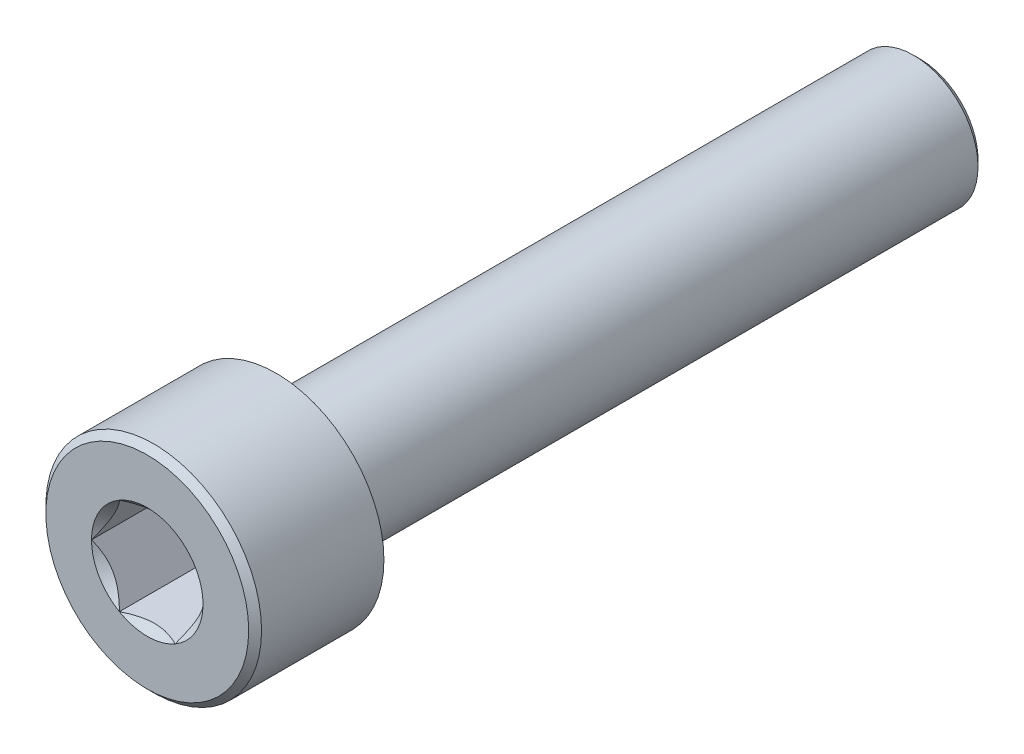
ISO-10303-21;
HEADER;
FILE_DESCRIPTION(('STEP AP214'),'2;1');
FILE_NAME('part.step','',(''),(''),'','','');
FILE_SCHEMA(('AUTOMOTIVE_DESIGN { 1 0 10303 214 1 1 1 1 }'));
ENDSEC;
DATA;
#1=APPLICATION_CONTEXT('core data for automotive mechanical design processes');
#2=APPLICATION_PROTOCOL_DEFINITION('international standard','automotive_design',2000,#1);
#3=PRODUCT_CONTEXT('',#1,'mechanical');
#4=PRODUCT('Part','Part','',(#3));
#5=PRODUCT_RELATED_PRODUCT_CATEGORY('part','',(#4));
#6=PRODUCT_DEFINITION_FORMATION('','',#4);
#7=PRODUCT_DEFINITION_CONTEXT('part definition',#1,'design');
#8=PRODUCT_DEFINITION('design','',#6,#7);
#9=PRODUCT_DEFINITION_SHAPE('','',#8);
#10=(LENGTH_UNIT() NAMED_UNIT(*) SI_UNIT(.MILLI.,.METRE.));
#11=(NAMED_UNIT(*) PLANE_ANGLE_UNIT() SI_UNIT($,.RADIAN.));
#12=(NAMED_UNIT(*) SI_UNIT($,.STERADIAN.) SOLID_ANGLE_UNIT());
#13=UNCERTAINTY_MEASURE_WITH_UNIT(LENGTH_MEASURE(1.E-05),#10,'distance_accuracy_value','');
#14=(GEOMETRIC_REPRESENTATION_CONTEXT(3) GLOBAL_UNCERTAINTY_ASSIGNED_CONTEXT((#13)) GLOBAL_UNIT_ASSIGNED_CONTEXT((#10,
#11,#12)) REPRESENTATION_CONTEXT('',''));
#15=CARTESIAN_POINT('',(0.,0.,0.));
#16=DIRECTION('',(0.,0.,1.));
#17=DIRECTION('',(1.,0.,0.));
#18=AXIS2_PLACEMENT_3D('',#15,#16,#17);
#19=CARTESIAN_POINT('',(0.,0.,0.));
#20=DIRECTION('',(0.,0.,1.));
#21=DIRECTION('',(1.,0.,0.));
#22=AXIS2_PLACEMENT_3D('',#19,#20,#21);
#23=PLANE('',#22);
#24=CARTESIAN_POINT('',(0.,0.,0.));
#25=DIRECTION('',(0.,0.,1.));
#26=DIRECTION('',(1.,0.,0.));
#27=AXIS2_PLACEMENT_3D('',#24,#25,#26);
#28=CIRCLE('',#27,3.35);
#29=CARTESIAN_POINT('',(3.35,0.,0.));
#30=VERTEX_POINT('',#29);
#31=EDGE_CURVE('E244',#30,#30,#28,.T.);
#32=ORIENTED_EDGE('',*,*,#31,.F.);
#33=EDGE_LOOP('',(#32));
#34=FACE_BOUND('',#33,.T.);
#35=CARTESIAN_POINT('',(0.,0.,0.));
#36=DIRECTION('',(0.,0.,1.));
#37=DIRECTION('',(1.,0.,0.));
#38=AXIS2_PLACEMENT_3D('',#35,#36,#37);
#39=CIRCLE('',#38,2.);
#40=CARTESIAN_POINT('',(2.,0.,0.));
#41=VERTEX_POINT('',#40);
#42=EDGE_CURVE('E109',#41,#41,#39,.F.);
#43=ORIENTED_EDGE('',*,*,#42,.F.);
#44=EDGE_LOOP('',(#43));
#45=FACE_BOUND('',#44,.T.);
#46=ADVANCED_FACE('F34',(#34,#45),#23,.F.);
#47=CARTESIAN_POINT('',(0.,0.,4.));
#48=DIRECTION('',(0.,0.,-1.));
#49=DIRECTION('',(-1.,0.,0.));
#50=AXIS2_PLACEMENT_3D('',#47,#48,#49);
#51=CYLINDRICAL_SURFACE('',#50,3.35);
#52=CARTESIAN_POINT('',(0.,0.,3.8));
#53=DIRECTION('',(0.,0.,1.));
#54=DIRECTION('',(1.,0.,0.));
#55=AXIS2_PLACEMENT_3D('',#52,#53,#54);
#56=CIRCLE('',#55,3.35);
#57=CARTESIAN_POINT('',(3.35,0.,3.8));
#58=VERTEX_POINT('',#57);
#59=EDGE_CURVE('E11',#58,#58,#56,.F.);
#60=ORIENTED_EDGE('',*,*,#59,.T.);
#61=EDGE_LOOP('',(#60));
#62=FACE_BOUND('',#61,.T.);
#63=ORIENTED_EDGE('',*,*,#31,.T.);
#64=EDGE_LOOP('',(#63));
#65=FACE_BOUND('',#64,.T.);
#66=ADVANCED_FACE('F185',(#62,#65),#51,.T.);
#67=CARTESIAN_POINT('',(0.,0.,4.));
#68=DIRECTION('',(0.,0.,1.));
#69=DIRECTION('',(1.,0.,0.));
#70=AXIS2_PLACEMENT_3D('',#67,#68,#69);
#71=PLANE('',#70);
#72=CARTESIAN_POINT('',(0.,0.,4.));
#73=DIRECTION('',(0.,0.,1.));
#74=DIRECTION('',(1.,0.,0.));
#75=AXIS2_PLACEMENT_3D('',#72,#73,#74);
#76=CIRCLE('',#75,3.15);
#77=CARTESIAN_POINT('',(3.15,0.,4.));
#78=VERTEX_POINT('',#77);
#79=EDGE_CURVE('E42',#78,#78,#76,.T.);
#80=ORIENTED_EDGE('',*,*,#79,.T.);
#81=EDGE_LOOP('',(#80));
#82=FACE_BOUND('',#81,.T.);
#83=CARTESIAN_POINT('',(0.,0.,4.));
#84=DIRECTION('',(0.,0.,1.));
#85=DIRECTION('',(1.,0.,0.));
#86=AXIS2_PLACEMENT_3D('',#83,#84,#85);
#87=CIRCLE('',#86,1.73205080756889);
#88=CARTESIAN_POINT('',(1.73205080756889,0.,4.));
#89=VERTEX_POINT('',#88);
#90=CARTESIAN_POINT('',(0.866025403784432,1.50000000000001,4.));
#91=VERTEX_POINT('',#90);
#92=EDGE_CURVE('E99',#89,#91,#87,.T.);
#93=ORIENTED_EDGE('',*,*,#92,.F.);
#94=CARTESIAN_POINT('',(0.866025403784432,-1.50000000000001,4.));
#95=VERTEX_POINT('',#94);
#96=EDGE_CURVE('E88',#95,#89,#87,.T.);
#97=ORIENTED_EDGE('',*,*,#96,.F.);
#98=CARTESIAN_POINT('',(-0.866025403784454,-1.5,4.));
#99=VERTEX_POINT('',#98);
#100=EDGE_CURVE('E97',#99,#95,#87,.T.);
#101=ORIENTED_EDGE('',*,*,#100,.F.);
#102=CARTESIAN_POINT('',(-1.73205080756889,0.,4.));
#103=VERTEX_POINT('',#102);
#104=EDGE_CURVE('E48',#103,#99,#87,.T.);
#105=ORIENTED_EDGE('',*,*,#104,.F.);
#106=CARTESIAN_POINT('',(-0.866025403784433,1.50000000000001,4.));
#107=VERTEX_POINT('',#106);
#108=EDGE_CURVE('E55',#107,#103,#87,.T.);
#109=ORIENTED_EDGE('',*,*,#108,.F.);
#110=EDGE_CURVE('E130',#91,#107,#87,.T.);
#111=ORIENTED_EDGE('',*,*,#110,.F.);
#112=EDGE_LOOP('',(#93,#97,#101,#105,#109,#111));
#113=FACE_BOUND('',#112,.T.);
#114=ADVANCED_FACE('F129',(#82,#113),#71,.T.);
#115=CARTESIAN_POINT('',(0.,0.,-20.));
#116=DIRECTION('',(0.,0.,1.));
#117=DIRECTION('',(1.,0.,0.));
#118=AXIS2_PLACEMENT_3D('',#115,#116,#117);
#119=CYLINDRICAL_SURFACE('',#118,2.);
#120=CARTESIAN_POINT('',(0.,0.,-19.8));
#121=DIRECTION('',(0.,0.,-1.));
#122=DIRECTION('',(-1.,0.,0.));
#123=AXIS2_PLACEMENT_3D('',#120,#121,#122);
#124=CIRCLE('',#123,2.);
#125=CARTESIAN_POINT('',(-2.,0.,-19.8));
#126=VERTEX_POINT('',#125);
#127=EDGE_CURVE('E170',#126,#126,#124,.F.);
#128=ORIENTED_EDGE('',*,*,#127,.T.);
#129=EDGE_LOOP('',(#128));
#130=FACE_BOUND('',#129,.T.);
#131=ORIENTED_EDGE('',*,*,#42,.T.);
#132=EDGE_LOOP('',(#131));
#133=FACE_BOUND('',#132,.T.);
#134=ADVANCED_FACE('F196',(#130,#133),#119,.T.);
#135=CARTESIAN_POINT('',(0.,0.,-20.));
#136=DIRECTION('',(0.,0.,-1.));
#137=DIRECTION('',(-1.,0.,0.));
#138=AXIS2_PLACEMENT_3D('',#135,#136,#137);
#139=PLANE('',#138);
#140=CARTESIAN_POINT('',(0.,0.,-20.));
#141=DIRECTION('',(0.,0.,-1.));
#142=DIRECTION('',(-1.,0.,0.));
#143=AXIS2_PLACEMENT_3D('',#140,#141,#142);
#144=CIRCLE('',#143,1.8);
#145=CARTESIAN_POINT('',(-1.8,0.,-20.));
#146=VERTEX_POINT('',#145);
#147=EDGE_CURVE('E108',#146,#146,#144,.T.);
#148=ORIENTED_EDGE('',*,*,#147,.T.);
#149=EDGE_LOOP('',(#148));
#150=FACE_BOUND('',#149,.T.);
#151=ADVANCED_FACE('F200',(#150),#139,.T.);
#152=CARTESIAN_POINT('',(0.,0.,4.));
#153=DIRECTION('',(0.,0.,1.));
#154=DIRECTION('',(1.,0.,0.));
#155=AXIS2_PLACEMENT_3D('',#152,#153,#154);
#156=CONICAL_SURFACE('',#155,1.73205080756889,0.78539816339745);
#157=ORIENTED_EDGE('',*,*,#92,.T.);
#158=CARTESIAN_POINT('',(1.73216627762272,-0.0002,4.00011548160007));
#159=CARTESIAN_POINT('',(1.70239359975915,0.0513677907370756,3.97036547606732));
#160=CARTESIAN_POINT('',(1.67212305186355,0.103797917665201,3.94236248391031));
#161=CARTESIAN_POINT('',(1.61039789003619,0.210709034055597,3.89108923044014));
#162=CARTESIAN_POINT('',(1.57893740312614,0.265200195814661,3.86784750504437));
#163=CARTESIAN_POINT('',(1.51549879897987,0.375079081357248,3.82803372899221));
#164=CARTESIAN_POINT('',(1.4835368452681,0.4304388090952,3.81136158567089));
#165=CARTESIAN_POINT('',(1.41890915196211,0.542377257477151,3.7856744568181));
#166=CARTESIAN_POINT('',(1.38624538781118,0.598952556553009,3.77664029047886));
#167=CARTESIAN_POINT('',(1.329952100953,0.696455389516441,3.76848908122684));
#168=CARTESIAN_POINT('',(1.30639533311124,0.737256908280467,3.76728225298921));
#169=CARTESIAN_POINT('',(1.25932335290194,0.818787969615859,3.76931405716226));
#170=CARTESIAN_POINT('',(1.23580815085313,0.859517494314631,3.7725536707483));
#171=CARTESIAN_POINT('',(1.18900414978427,0.940584402163417,3.78329198598195));
#172=CARTESIAN_POINT('',(1.1657155821172,0.980921384598289,3.79079465301873));
#173=CARTESIAN_POINT('',(1.11952932016335,1.06091833691403,3.80965161192828));
#174=CARTESIAN_POINT('',(1.09663179808786,1.10057800851621,3.82100755701858));
#175=CARTESIAN_POINT('',(1.03798159809698,1.20216313477449,3.85472164759266));
#176=CARTESIAN_POINT('',(1.00259267147465,1.26345855370969,3.87962184909336));
#177=CARTESIAN_POINT('',(0.950557780604371,1.35358562846332,3.92165665327157));
#178=CARTESIAN_POINT('',(0.933410759677143,1.38328513990773,3.93642515355909));
#179=CARTESIAN_POINT('',(0.899432101996402,1.44213790138376,3.96731056594017));
#180=CARTESIAN_POINT('',(0.882600319285704,1.47129140422065,3.98342683412171));
#181=CARTESIAN_POINT('',(0.865909933730595,1.50020000000001,4.00011548160007));
#182=B_SPLINE_CURVE_WITH_KNOTS('',3,(#158,#159,#160,#161,#162,#163,#164,#165,#166,#167,#168,
#169,#170,#171,#172,#173,#174,#175,#176,#177,#178,#179,#180,#181),.UNSPECIFIED.,.F.,.F.,(4,2,2,
2,2,2,2,2,2,2,2,4),(0.,0.199829143693305,0.400822987382389,0.598623720538181,0.79592624018889,
0.937113067959882,1.07833105577193,1.21968061668222,1.36109089931055,1.58570969637566,
1.69770705470965,1.80965120737195),.UNSPECIFIED.);
#183=EDGE_CURVE('E103',#89,#91,#182,.T.);
#184=ORIENTED_EDGE('',*,*,#183,.F.);
#185=EDGE_LOOP('',(#157,#184));
#186=FACE_BOUND('',#185,.T.);
#187=ADVANCED_FACE('F104',(#186),#156,.F.);
#188=ORIENTED_EDGE('',*,*,#110,.T.);
#189=CARTESIAN_POINT('',(-1.72720812969693,1.50000000000001,4.5555785162708));
#190=CARTESIAN_POINT('',(-1.68515175699269,1.50000000000001,4.52382990785743));
#191=CARTESIAN_POINT('',(-1.64286104748674,1.50000000000001,4.49239259380739));
#192=CARTESIAN_POINT('',(-1.55771581035943,1.50000000000001,4.43026908755641));
#193=CARTESIAN_POINT('',(-1.51486114386669,1.50000000000001,4.39958308589221));
#194=CARTESIAN_POINT('',(-1.38468134151271,1.50000000000001,4.30840719242717));
#195=CARTESIAN_POINT('',(-1.29637976071654,1.50000000000001,4.24928834342678));
#196=CARTESIAN_POINT('',(-1.11121478730468,1.50000000000001,4.13323099631651));
#197=CARTESIAN_POINT('',(-1.01415038238168,1.50000000000001,4.07660955873301));
#198=CARTESIAN_POINT('',(-0.815173408897608,1.50000000000001,3.97303688126566));
#199=CARTESIAN_POINT('',(-0.713278669253288,1.50000000000001,3.92605304154167));
#200=CARTESIAN_POINT('',(-0.560333774943113,1.50000000000001,3.86857266843083));
#201=CARTESIAN_POINT('',(-0.511547982948043,1.50000000000001,3.85207538775725));
#202=CARTESIAN_POINT('',(-0.412798620136867,1.50000000000001,3.82299751292701));
#203=CARTESIAN_POINT('',(-0.362834968437563,1.50000000000001,3.81041718859402));
#204=CARTESIAN_POINT('',(-0.262863235444982,1.50000000000001,3.79003619414677));
#205=CARTESIAN_POINT('',(-0.212872113808022,1.50000000000001,3.78215363274599));
#206=CARTESIAN_POINT('',(-0.112355243569544,1.50000000000001,3.77132206396901));
#207=CARTESIAN_POINT('',(-0.061829588372626,1.50000000000001,3.76837220852436));
#208=CARTESIAN_POINT('',(0.0374291733323867,1.50000000000001,3.76762485772485));
#209=CARTESIAN_POINT('',(0.0861609672003019,1.50000000000001,3.76964473355808));
#210=CARTESIAN_POINT('',(0.18320693776883,1.50000000000001,3.77832255289676));
#211=CARTESIAN_POINT('',(0.231521073438273,1.50000000000001,3.78498094696846));
#212=CARTESIAN_POINT('',(0.32819985342544,1.50000000000001,3.80268524412257));
#213=CARTESIAN_POINT('',(0.376550616310333,1.50000000000001,3.81380581125704));
#214=CARTESIAN_POINT('',(0.472195697125604,1.50000000000001,3.83984341404872));
#215=CARTESIAN_POINT('',(0.519490103092746,1.50000000000001,3.85476013204094));
#216=CARTESIAN_POINT('',(0.668391282696632,1.50000000000001,3.90733522359608));
#217=CARTESIAN_POINT('',(0.767878709508561,1.50000000000001,3.95098128747198));
#218=CARTESIAN_POINT('',(0.962179866690734,1.50000000000001,4.04802299459311));
#219=CARTESIAN_POINT('',(1.05697519961445,1.50000000000001,4.10145366508954));
#220=CARTESIAN_POINT('',(1.23814273533384,1.50000000000001,4.21168585200457));
#221=CARTESIAN_POINT('',(1.32469942181291,1.50000000000001,4.26818792069861));
#222=CARTESIAN_POINT('',(1.45222331290675,1.50000000000001,4.35553430157867));
#223=CARTESIAN_POINT('',(1.49418091978757,1.50000000000001,4.38495775868006));
#224=CARTESIAN_POINT('',(1.57752272931478,1.50000000000001,4.44458282183048));
#225=CARTESIAN_POINT('',(1.61890708647356,1.50000000000001,4.47478421166445));
#226=CARTESIAN_POINT('',(1.66005278019496,1.50000000000001,4.50530817860947));
#227=B_SPLINE_CURVE_WITH_KNOTS('',3,(#189,#190,#191,#192,#193,#194,#195,#196,#197,#198,#199,
#200,#201,#202,#203,#204,#205,#206,#207,#208,#209,#210,#211,#212,#213,#214,#215,#216,#217,#218,
#219,#220,#221,#222,#223,#224,#225,#226),.UNSPECIFIED.,.F.,.F.,(4,2,2,2,2,2,2,2,2,2,2,2,2,2,2,2,
2,2,4),(0.,0.158079548982669,0.316198780993943,0.634850417346961,0.971690311361514,
1.30737131660667,1.46173961127089,1.61611853740678,1.7677210142141,1.91929742368539,
2.06538741209601,2.21149159305545,2.36014984633874,2.50879566386711,2.83376031422675,
3.15991186985654,3.469856018022,3.62358896039976,3.77727962642073),.UNSPECIFIED.);
#228=EDGE_CURVE('E131',#91,#107,#227,.F.);
#229=ORIENTED_EDGE('',*,*,#228,.F.);
#230=EDGE_LOOP('',(#188,#229));
#231=FACE_BOUND('',#230,.T.);
#232=ADVANCED_FACE('F271',(#231),#156,.F.);
#233=ORIENTED_EDGE('',*,*,#108,.T.);
#234=CARTESIAN_POINT('',(-0.865909933730605,1.50020000000001,4.00011548160008));
#235=CARTESIAN_POINT('',(-0.89568261159417,1.44863220926294,3.97036547606733));
#236=CARTESIAN_POINT('',(-0.92595315948977,1.39620208233481,3.94236248391032));
#237=CARTESIAN_POINT('',(-0.987678321317129,1.28929096594441,3.89108923044015));
#238=CARTESIAN_POINT('',(-1.01913880822718,1.23479980418535,3.86784750504438));
#239=CARTESIAN_POINT('',(-1.08257741237345,1.12492091864276,3.82803372899222));
#240=CARTESIAN_POINT('',(-1.11453936608522,1.06956119090481,3.8113615856709));
#241=CARTESIAN_POINT('',(-1.17916705939121,0.957622742522856,3.7856744568181));
#242=CARTESIAN_POINT('',(-1.21183082354214,0.901047443446997,3.77664029047887));
#243=CARTESIAN_POINT('',(-1.26812411040033,0.803544610483564,3.76848908122685));
#244=CARTESIAN_POINT('',(-1.29168087824209,0.762743091719538,3.76728225298922));
#245=CARTESIAN_POINT('',(-1.33875285845139,0.681212030384145,3.76931405716227));
#246=CARTESIAN_POINT('',(-1.36226806050019,0.640482505685373,3.77255367074831));
#247=CARTESIAN_POINT('',(-1.40907206156906,0.559415597836587,3.78329198598196));
#248=CARTESIAN_POINT('',(-1.43236062923613,0.519078615401715,3.79079465301873));
#249=CARTESIAN_POINT('',(-1.47854689118997,0.439081663085971,3.80965161192829));
#250=CARTESIAN_POINT('',(-1.50144441326546,0.399421991483794,3.82100755701859));
#251=CARTESIAN_POINT('',(-1.56009461325634,0.297836865225516,3.85472164759267));
#252=CARTESIAN_POINT('',(-1.59548353987867,0.236541446290311,3.87962184909337));
#253=CARTESIAN_POINT('',(-1.64751843074895,0.146414371536685,3.92165665327158));
#254=CARTESIAN_POINT('',(-1.66466545167618,0.11671486009228,3.9364251535591));
#255=CARTESIAN_POINT('',(-1.69864410935692,0.0578620986162462,3.96731056594017));
#256=CARTESIAN_POINT('',(-1.71547589206762,0.0287085957793595,3.98342683412171));
#257=CARTESIAN_POINT('',(-1.73216627762273,-0.000200000000003567,4.00011548160008));
#258=B_SPLINE_CURVE_WITH_KNOTS('',3,(#234,#235,#236,#237,#238,#239,#240,#241,#242,#243,#244,
#245,#246,#247,#248,#249,#250,#251,#252,#253,#254,#255,#256,#257),.UNSPECIFIED.,.F.,.F.,(4,2,2,
2,2,2,2,2,2,2,2,4),(0.,0.199829143693307,0.400822987382394,0.598623720538188,0.7959262401889,
0.937113067959893,1.07833105577194,1.21968061668223,1.36109089931056,1.58570969637567,
1.69770705470965,1.80965120737196),.UNSPECIFIED.);
#259=EDGE_CURVE('E133',#107,#103,#258,.T.);
#260=ORIENTED_EDGE('',*,*,#259,.F.);
#261=EDGE_LOOP('',(#233,#260));
#262=FACE_BOUND('',#261,.T.);
#263=ADVANCED_FACE('F268',(#262),#156,.F.);
#264=ORIENTED_EDGE('',*,*,#104,.T.);
#265=CARTESIAN_POINT('',(-1.73216627762273,0.000199999999996531,4.00011548160008));
#266=CARTESIAN_POINT('',(-1.70239359975916,-0.0513677907370794,3.97036547606733));
#267=CARTESIAN_POINT('',(-1.67212305186356,-0.103797917665205,3.94236248391032));
#268=CARTESIAN_POINT('',(-1.6103978900362,-0.210709034055601,3.89108923044015));
#269=CARTESIAN_POINT('',(-1.57893740312615,-0.265200195814666,3.86784750504438));
#270=CARTESIAN_POINT('',(-1.51549879897988,-0.375079081357253,3.82803372899222));
#271=CARTESIAN_POINT('',(-1.48353684526811,-0.430438809095205,3.8113615856709));
#272=CARTESIAN_POINT('',(-1.41890915196212,-0.542377257477156,3.78567445681811));
#273=CARTESIAN_POINT('',(-1.38624538781119,-0.598952556553014,3.77664029047887));
#274=CARTESIAN_POINT('',(-1.32995210095301,-0.696455389516447,3.76848908122686));
#275=CARTESIAN_POINT('',(-1.30639533311125,-0.737256908280473,3.76728225298922));
#276=CARTESIAN_POINT('',(-1.25932335290195,-0.818787969615865,3.76931405716227));
#277=CARTESIAN_POINT('',(-1.23580815085314,-0.859517494314637,3.77255367074831));
#278=CARTESIAN_POINT('',(-1.18900414978428,-0.940584402163424,3.78329198598197));
#279=CARTESIAN_POINT('',(-1.16571558211721,-0.980921384598297,3.79079465301874));
#280=CARTESIAN_POINT('',(-1.11952932016336,-1.06091833691404,3.8096516119283));
#281=CARTESIAN_POINT('',(-1.09663179808787,-1.10057800851622,3.82100755701859));
#282=CARTESIAN_POINT('',(-1.03798159809699,-1.20216313477449,3.85472164759268));
#283=CARTESIAN_POINT('',(-1.00259267147466,-1.2634585537097,3.87962184909337));
#284=CARTESIAN_POINT('',(-0.950557780604385,-1.35358562846332,3.92165665327158));
#285=CARTESIAN_POINT('',(-0.933410759677158,-1.38328513990773,3.9364251535591));
#286=CARTESIAN_POINT('',(-0.899432101996418,-1.44213790138376,3.96731056594017));
#287=CARTESIAN_POINT('',(-0.882600319285721,-1.47129140422065,3.98342683412172));
#288=CARTESIAN_POINT('',(-0.865909933730612,-1.50020000000001,4.00011548160008));
#289=B_SPLINE_CURVE_WITH_KNOTS('',3,(#265,#266,#267,#268,#269,#270,#271,#272,#273,#274,#275,
#276,#277,#278,#279,#280,#281,#282,#283,#284,#285,#286,#287,#288),.UNSPECIFIED.,.F.,.F.,(4,2,2,
2,2,2,2,2,2,2,2,4),(0.,0.199829143693305,0.40082298738239,0.598623720538182,0.795926240188891,
0.937113067959884,1.07833105577193,1.21968061668222,1.36109089931055,1.58570969637566,
1.69770705470964,1.80965120737194),.UNSPECIFIED.);
#290=EDGE_CURVE('E222',#103,#99,#289,.T.);
#291=ORIENTED_EDGE('',*,*,#290,.F.);
#292=EDGE_LOOP('',(#264,#291));
#293=FACE_BOUND('',#292,.T.);
#294=ADVANCED_FACE('F270',(#293),#156,.F.);
#295=ORIENTED_EDGE('',*,*,#100,.T.);
#296=CARTESIAN_POINT('',(-1.72720812969695,-1.50000000000001,4.55557851627081));
#297=CARTESIAN_POINT('',(-1.6851517569927,-1.50000000000001,4.52382990785744));
#298=CARTESIAN_POINT('',(-1.64286104748676,-1.50000000000001,4.4923925938074));
#299=CARTESIAN_POINT('',(-1.55771581035944,-1.50000000000001,4.43026908755642));
#300=CARTESIAN_POINT('',(-1.5148611438667,-1.50000000000001,4.39958308589221));
#301=CARTESIAN_POINT('',(-1.38468134151272,-1.50000000000001,4.30840719242717));
#302=CARTESIAN_POINT('',(-1.29637976071655,-1.50000000000001,4.24928834342678));
#303=CARTESIAN_POINT('',(-1.11121478730469,-1.50000000000001,4.13323099631651));
#304=CARTESIAN_POINT('',(-1.01415038238169,-1.50000000000001,4.07660955873301));
#305=CARTESIAN_POINT('',(-0.815173408897617,-1.50000000000001,3.97303688126566));
#306=CARTESIAN_POINT('',(-0.713278669253296,-1.50000000000001,3.92605304154167));
#307=CARTESIAN_POINT('',(-0.56033377494312,-1.50000000000001,3.86857266843083));
#308=CARTESIAN_POINT('',(-0.51154798294805,-1.50000000000001,3.85207538775725));
#309=CARTESIAN_POINT('',(-0.412798620136874,-1.50000000000001,3.82299751292701));
#310=CARTESIAN_POINT('',(-0.362834968437569,-1.50000000000001,3.81041718859402));
#311=CARTESIAN_POINT('',(-0.262863235444988,-1.50000000000001,3.79003619414677));
#312=CARTESIAN_POINT('',(-0.212872113808028,-1.50000000000001,3.78215363274598));
#313=CARTESIAN_POINT('',(-0.11235524356955,-1.50000000000001,3.771322063969));
#314=CARTESIAN_POINT('',(-0.0618295883726318,-1.50000000000001,3.76837220852435));
#315=CARTESIAN_POINT('',(0.0374291733323812,-1.50000000000001,3.76762485772485));
#316=CARTESIAN_POINT('',(0.0861609672002966,-1.50000000000001,3.76964473355807));
#317=CARTESIAN_POINT('',(0.183206937768825,-1.50000000000001,3.77832255289676));
#318=CARTESIAN_POINT('',(0.231521073438268,-1.50000000000001,3.78498094696846));
#319=CARTESIAN_POINT('',(0.328199853425436,-1.50000000000001,3.80268524412257));
#320=CARTESIAN_POINT('',(0.376550616310329,-1.50000000000001,3.81380581125704));
#321=CARTESIAN_POINT('',(0.4721956971256,-1.50000000000001,3.83984341404871));
#322=CARTESIAN_POINT('',(0.519490103092742,-1.50000000000001,3.85476013204094));
#323=CARTESIAN_POINT('',(0.668391282696627,-1.50000000000001,3.90733522359607));
#324=CARTESIAN_POINT('',(0.767878709508556,-1.50000000000001,3.95098128747198));
#325=CARTESIAN_POINT('',(0.962179866690728,-1.50000000000001,4.0480229945931));
#326=CARTESIAN_POINT('',(1.05697519961444,-1.50000000000001,4.10145366508953));
#327=CARTESIAN_POINT('',(1.23814273533383,-1.50000000000001,4.21168585200456));
#328=CARTESIAN_POINT('',(1.3246994218129,-1.50000000000001,4.2681879206986));
#329=CARTESIAN_POINT('',(1.45222331290674,-1.50000000000001,4.35553430157866));
#330=CARTESIAN_POINT('',(1.49418091978756,-1.50000000000001,4.38495775868005));
#331=CARTESIAN_POINT('',(1.57752272931477,-1.50000000000001,4.44458282183047));
#332=CARTESIAN_POINT('',(1.61890708647355,-1.50000000000001,4.47478421166444));
#333=CARTESIAN_POINT('',(1.66005278019495,-1.50000000000001,4.50530817860946));
#334=B_SPLINE_CURVE_WITH_KNOTS('',3,(#296,#297,#298,#299,#300,#301,#302,#303,#304,#305,#306,
#307,#308,#309,#310,#311,#312,#313,#314,#315,#316,#317,#318,#319,#320,#321,#322,#323,#324,#325,
#326,#327,#328,#329,#330,#331,#332,#333),.UNSPECIFIED.,.F.,.F.,(4,2,2,2,2,2,2,2,2,2,2,2,2,2,2,2,
2,2,4),(0.,0.158079548982671,0.316198780993946,0.634850417346966,0.971690311361522,
1.30737131660669,1.4617396112709,1.61611853740679,1.76772101421412,1.9192974236854,
2.06538741209603,2.21149159305547,2.36014984633875,2.50879566386712,2.83376031422676,
3.15991186985655,3.46985601802201,3.62358896039977,3.77727962642074),.UNSPECIFIED.);
#335=EDGE_CURVE('E119',#99,#95,#334,.T.);
#336=ORIENTED_EDGE('',*,*,#335,.F.);
#337=EDGE_LOOP('',(#295,#336));
#338=FACE_BOUND('',#337,.T.);
#339=ADVANCED_FACE('F264',(#338),#156,.F.);
#340=ORIENTED_EDGE('',*,*,#96,.T.);
#341=CARTESIAN_POINT('',(0.865909933730595,-1.50020000000001,4.00011548160007));
#342=CARTESIAN_POINT('',(0.89568261159416,-1.44863220926293,3.97036547606732));
#343=CARTESIAN_POINT('',(0.92595315948976,-1.39620208233481,3.94236248391031));
#344=CARTESIAN_POINT('',(0.987678321317119,-1.28929096594441,3.89108923044014));
#345=CARTESIAN_POINT('',(1.01913880822717,-1.23479980418534,3.86784750504437));
#346=CARTESIAN_POINT('',(1.08257741237344,-1.12492091864276,3.82803372899221));
#347=CARTESIAN_POINT('',(1.11453936608521,-1.06956119090481,3.81136158567089));
#348=CARTESIAN_POINT('',(1.1791670593912,-0.957622742522853,3.78567445681809));
#349=CARTESIAN_POINT('',(1.21183082354213,-0.901047443446995,3.77664029047886));
#350=CARTESIAN_POINT('',(1.26812411040032,-0.803544610483562,3.76848908122684));
#351=CARTESIAN_POINT('',(1.29168087824208,-0.762743091719537,3.76728225298921));
#352=CARTESIAN_POINT('',(1.33875285845138,-0.681212030384145,3.76931405716226));
#353=CARTESIAN_POINT('',(1.36226806050018,-0.640482505685373,3.7725536707483));
#354=CARTESIAN_POINT('',(1.40907206156905,-0.559415597836587,3.78329198598195));
#355=CARTESIAN_POINT('',(1.43236062923612,-0.519078615401715,3.79079465301872));
#356=CARTESIAN_POINT('',(1.47854689118996,-0.439081663085972,3.80965161192828));
#357=CARTESIAN_POINT('',(1.50144441326545,-0.399421991483795,3.82100755701858));
#358=CARTESIAN_POINT('',(1.56009461325633,-0.297836865225517,3.85472164759266));
#359=CARTESIAN_POINT('',(1.59548353987866,-0.236541446290313,3.87962184909336));
#360=CARTESIAN_POINT('',(1.64751843074894,-0.146414371536687,3.92165665327157));
#361=CARTESIAN_POINT('',(1.66466545167617,-0.116714860092283,3.93642515355909));
#362=CARTESIAN_POINT('',(1.69864410935691,-0.0578620986162493,3.96731056594016));
#363=CARTESIAN_POINT('',(1.71547589206761,-0.0287085957793629,3.9834268341217));
#364=CARTESIAN_POINT('',(1.73216627762272,0.00020000000000015,4.00011548160007));
#365=B_SPLINE_CURVE_WITH_KNOTS('',3,(#341,#342,#343,#344,#345,#346,#347,#348,#349,#350,#351,
#352,#353,#354,#355,#356,#357,#358,#359,#360,#361,#362,#363,#364),.UNSPECIFIED.,.F.,.F.,(4,2,2,
2,2,2,2,2,2,2,2,4),(0.,0.199829143693306,0.400822987382392,0.598623720538186,0.795926240188897,
0.937113067959889,1.07833105577194,1.21968061668223,1.36109089931055,1.58570969637567,
1.69770705470965,1.80965120737195),.UNSPECIFIED.);
#366=EDGE_CURVE('E92',#95,#89,#365,.T.);
#367=ORIENTED_EDGE('',*,*,#366,.F.);
#368=EDGE_LOOP('',(#340,#367));
#369=FACE_BOUND('',#368,.T.);
#370=ADVANCED_FACE('F90',(#369),#156,.F.);
#371=CARTESIAN_POINT('',(0.,0.,1.2));
#372=DIRECTION('',(0.,0.,1.));
#373=DIRECTION('',(1.,0.,0.));
#374=AXIS2_PLACEMENT_3D('',#371,#372,#373);
#375=PLANE('',#374);
#376=DIRECTION('',(0.500000000000001,0.866025403784438,0.));
#377=VECTOR('',#376,1.);
#378=CARTESIAN_POINT('',(0.866025403784432,-1.50000000000001,1.2));
#379=LINE('',#378,#377);
#380=CARTESIAN_POINT('',(0.866025403784432,-1.50000000000001,1.2));
#381=VERTEX_POINT('',#380);
#382=CARTESIAN_POINT('',(1.73205080756888,0.,1.2));
#383=VERTEX_POINT('',#382);
#384=EDGE_CURVE('E118',#381,#383,#379,.T.);
#385=ORIENTED_EDGE('',*,*,#384,.T.);
#386=DIRECTION('',(-0.5,0.866025403784439,0.));
#387=VECTOR('',#386,1.);
#388=CARTESIAN_POINT('',(1.73205080756888,0.,1.2));
#389=LINE('',#388,#387);
#390=CARTESIAN_POINT('',(0.866025403784432,1.50000000000001,1.2));
#391=VERTEX_POINT('',#390);
#392=EDGE_CURVE('E123',#383,#391,#389,.T.);
#393=ORIENTED_EDGE('',*,*,#392,.T.);
#394=DIRECTION('',(-1.,0.,0.));
#395=VECTOR('',#394,1.);
#396=CARTESIAN_POINT('',(0.866025403784432,1.50000000000001,1.2));
#397=LINE('',#396,#395);
#398=CARTESIAN_POINT('',(-0.866025403784443,1.50000000000001,1.2));
#399=VERTEX_POINT('',#398);
#400=EDGE_CURVE('E232',#391,#399,#397,.T.);
#401=ORIENTED_EDGE('',*,*,#400,.T.);
#402=DIRECTION('',(-0.499999999999999,-0.866025403784439,0.));
#403=VECTOR('',#402,1.);
#404=CARTESIAN_POINT('',(-0.866025403784443,1.50000000000001,1.2));
#405=LINE('',#404,#403);
#406=CARTESIAN_POINT('',(-1.73205080756889,0.,1.2));
#407=VERTEX_POINT('',#406);
#408=EDGE_CURVE('E235',#399,#407,#405,.T.);
#409=ORIENTED_EDGE('',*,*,#408,.T.);
#410=DIRECTION('',(0.499999999999999,-0.866025403784439,0.));
#411=VECTOR('',#410,1.);
#412=CARTESIAN_POINT('',(-1.73205080756889,0.,1.2));
#413=LINE('',#412,#411);
#414=CARTESIAN_POINT('',(-0.86602540378445,-1.50000000000001,1.2));
#415=VERTEX_POINT('',#414);
#416=EDGE_CURVE('E238',#407,#415,#413,.T.);
#417=ORIENTED_EDGE('',*,*,#416,.T.);
#418=DIRECTION('',(1.,0.,0.));
#419=VECTOR('',#418,1.);
#420=CARTESIAN_POINT('',(-0.86602540378445,-1.50000000000001,1.2));
#421=LINE('',#420,#419);
#422=EDGE_CURVE('E126',#415,#381,#421,.T.);
#423=ORIENTED_EDGE('',*,*,#422,.T.);
#424=EDGE_LOOP('',(#385,#393,#401,#409,#417,#423));
#425=FACE_BOUND('',#424,.T.);
#426=ADVANCED_FACE('F159',(#425),#375,.T.);
#427=CARTESIAN_POINT('',(1.73205080756888,0.,1.2));
#428=DIRECTION('',(0.866025403784439,0.5,0.));
#429=DIRECTION('',(-0.5,0.866025403784439,0.));
#430=AXIS2_PLACEMENT_3D('',#427,#428,#429);
#431=PLANE('',#430);
#432=DIRECTION('',(0.,0.,1.));
#433=VECTOR('',#432,1.);
#434=CARTESIAN_POINT('',(1.73205080756888,0.,1.2));
#435=LINE('',#434,#433);
#436=EDGE_CURVE('E114',#383,#89,#435,.T.);
#437=ORIENTED_EDGE('',*,*,#436,.T.);
#438=ORIENTED_EDGE('',*,*,#183,.T.);
#439=DIRECTION('',(0.,0.,1.));
#440=VECTOR('',#439,1.);
#441=CARTESIAN_POINT('',(0.866025403784432,1.50000000000001,1.2));
#442=LINE('',#441,#440);
#443=EDGE_CURVE('E125',#391,#91,#442,.T.);
#444=ORIENTED_EDGE('',*,*,#443,.F.);
#445=ORIENTED_EDGE('',*,*,#392,.F.);
#446=EDGE_LOOP('',(#437,#438,#444,#445));
#447=FACE_BOUND('',#446,.T.);
#448=ADVANCED_FACE('F121',(#447),#431,.F.);
#449=CARTESIAN_POINT('',(0.866025403784432,1.50000000000001,1.2));
#450=DIRECTION('',(0.,1.,0.));
#451=DIRECTION('',(0.,0.,1.));
#452=AXIS2_PLACEMENT_3D('',#449,#450,#451);
#453=PLANE('',#452);
#454=ORIENTED_EDGE('',*,*,#443,.T.);
#455=ORIENTED_EDGE('',*,*,#228,.T.);
#456=DIRECTION('',(0.,0.,1.));
#457=VECTOR('',#456,1.);
#458=CARTESIAN_POINT('',(-0.866025403784443,1.50000000000001,1.2));
#459=LINE('',#458,#457);
#460=EDGE_CURVE('E251',#399,#107,#459,.T.);
#461=ORIENTED_EDGE('',*,*,#460,.F.);
#462=ORIENTED_EDGE('',*,*,#400,.F.);
#463=EDGE_LOOP('',(#454,#455,#461,#462));
#464=FACE_BOUND('',#463,.T.);
#465=ADVANCED_FACE('F148',(#464),#453,.F.);
#466=CARTESIAN_POINT('',(-0.866025403784443,1.50000000000001,1.2));
#467=DIRECTION('',(-0.866025403784439,0.499999999999999,0.));
#468=DIRECTION('',(-0.499999999999999,-0.866025403784439,0.));
#469=AXIS2_PLACEMENT_3D('',#466,#467,#468);
#470=PLANE('',#469);
#471=ORIENTED_EDGE('',*,*,#460,.T.);
#472=ORIENTED_EDGE('',*,*,#259,.T.);
#473=DIRECTION('',(0.,0.,1.));
#474=VECTOR('',#473,1.);
#475=CARTESIAN_POINT('',(-1.73205080756889,0.,1.2));
#476=LINE('',#475,#474);
#477=EDGE_CURVE('E248',#407,#103,#476,.T.);
#478=ORIENTED_EDGE('',*,*,#477,.F.);
#479=ORIENTED_EDGE('',*,*,#408,.F.);
#480=EDGE_LOOP('',(#471,#472,#478,#479));
#481=FACE_BOUND('',#480,.T.);
#482=ADVANCED_FACE('F152',(#481),#470,.F.);
#483=CARTESIAN_POINT('',(-1.73205080756889,0.,1.2));
#484=DIRECTION('',(-0.866025403784439,-0.499999999999999,0.));
#485=DIRECTION('',(0.499999999999999,-0.866025403784439,0.));
#486=AXIS2_PLACEMENT_3D('',#483,#484,#485);
#487=PLANE('',#486);
#488=ORIENTED_EDGE('',*,*,#477,.T.);
#489=ORIENTED_EDGE('',*,*,#290,.T.);
#490=DIRECTION('',(0.,0.,1.));
#491=VECTOR('',#490,1.);
#492=CARTESIAN_POINT('',(-0.86602540378445,-1.50000000000001,1.2));
#493=LINE('',#492,#491);
#494=EDGE_CURVE('E245',#415,#99,#493,.T.);
#495=ORIENTED_EDGE('',*,*,#494,.F.);
#496=ORIENTED_EDGE('',*,*,#416,.F.);
#497=EDGE_LOOP('',(#488,#489,#495,#496));
#498=FACE_BOUND('',#497,.T.);
#499=ADVANCED_FACE('F215',(#498),#487,.F.);
#500=CARTESIAN_POINT('',(-0.86602540378445,-1.50000000000001,1.2));
#501=DIRECTION('',(0.,-1.,0.));
#502=DIRECTION('',(0.,0.,-1.));
#503=AXIS2_PLACEMENT_3D('',#500,#501,#502);
#504=PLANE('',#503);
#505=ORIENTED_EDGE('',*,*,#494,.T.);
#506=ORIENTED_EDGE('',*,*,#335,.T.);
#507=DIRECTION('',(0.,0.,1.));
#508=VECTOR('',#507,1.);
#509=CARTESIAN_POINT('',(0.866025403784432,-1.50000000000001,1.2));
#510=LINE('',#509,#508);
#511=EDGE_CURVE('E116',#381,#95,#510,.T.);
#512=ORIENTED_EDGE('',*,*,#511,.F.);
#513=ORIENTED_EDGE('',*,*,#422,.F.);
#514=EDGE_LOOP('',(#505,#506,#512,#513));
#515=FACE_BOUND('',#514,.T.);
#516=ADVANCED_FACE('F212',(#515),#504,.F.);
#517=CARTESIAN_POINT('',(0.866025403784432,-1.50000000000001,1.2));
#518=DIRECTION('',(0.866025403784438,-0.500000000000001,0.));
#519=DIRECTION('',(0.500000000000001,0.866025403784438,0.));
#520=AXIS2_PLACEMENT_3D('',#517,#518,#519);
#521=PLANE('',#520);
#522=ORIENTED_EDGE('',*,*,#511,.T.);
#523=ORIENTED_EDGE('',*,*,#366,.T.);
#524=ORIENTED_EDGE('',*,*,#436,.F.);
#525=ORIENTED_EDGE('',*,*,#384,.F.);
#526=EDGE_LOOP('',(#522,#523,#524,#525));
#527=FACE_BOUND('',#526,.T.);
#528=ADVANCED_FACE('F112',(#527),#521,.F.);
#529=CARTESIAN_POINT('',(0.,0.,-20.));
#530=DIRECTION('',(0.,0.,1.));
#531=DIRECTION('',(1.,0.,0.));
#532=AXIS2_PLACEMENT_3D('',#529,#530,#531);
#533=CONICAL_SURFACE('',#532,1.8,0.785398163397453);
#534=ORIENTED_EDGE('',*,*,#127,.F.);
#535=EDGE_LOOP('',(#534));
#536=FACE_BOUND('',#535,.T.);
#537=ORIENTED_EDGE('',*,*,#147,.F.);
#538=EDGE_LOOP('',(#537));
#539=FACE_BOUND('',#538,.T.);
#540=ADVANCED_FACE('F177',(#536,#539),#533,.T.);
#541=CARTESIAN_POINT('',(0.,0.,4.));
#542=DIRECTION('',(0.,0.,-1.));
#543=DIRECTION('',(-1.,0.,0.));
#544=AXIS2_PLACEMENT_3D('',#541,#542,#543);
#545=CONICAL_SURFACE('',#544,3.15,0.785398163397447);
#546=ORIENTED_EDGE('',*,*,#59,.F.);
#547=EDGE_LOOP('',(#546));
#548=FACE_BOUND('',#547,.T.);
#549=ORIENTED_EDGE('',*,*,#79,.F.);
#550=EDGE_LOOP('',(#549));
#551=FACE_BOUND('',#550,.T.);
#552=ADVANCED_FACE('F36',(#548,#551),#545,.T.);
#553=CLOSED_SHELL('',(#46,#66,#114,#134,#151,#187,#232,#263,#294,#339,#370,#426,#448,#465,#482,
#499,#516,#528,#540,#552));
#554=MANIFOLD_SOLID_BREP('B2',#553);
#555=ADVANCED_BREP_SHAPE_REPRESENTATION('',(#18,#554),#14);
#556=SHAPE_DEFINITION_REPRESENTATION(#9,#555);
ENDSEC;
END-ISO-10303-21;
